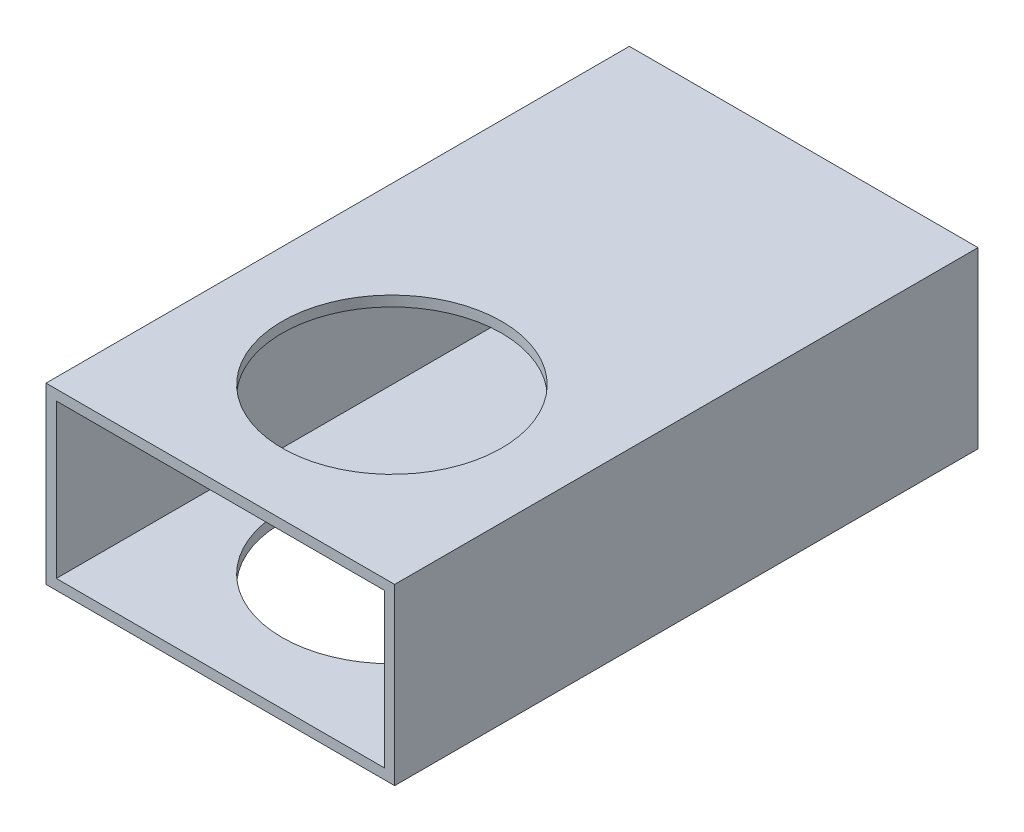
ISO-10303-21;
HEADER;
FILE_DESCRIPTION(('STEP AP214'),'2;1');
FILE_NAME('part.step','',(''),(''),'','','');
FILE_SCHEMA(('AUTOMOTIVE_DESIGN { 1 0 10303 214 1 1 1 1 }'));
ENDSEC;
DATA;
#1=APPLICATION_CONTEXT('core data for automotive mechanical design processes');
#2=APPLICATION_PROTOCOL_DEFINITION('international standard','automotive_design',2000,#1);
#3=PRODUCT_CONTEXT('',#1,'mechanical');
#4=PRODUCT('Part','Part','',(#3));
#5=PRODUCT_RELATED_PRODUCT_CATEGORY('part','',(#4));
#6=PRODUCT_DEFINITION_FORMATION('','',#4);
#7=PRODUCT_DEFINITION_CONTEXT('part definition',#1,'design');
#8=PRODUCT_DEFINITION('design','',#6,#7);
#9=PRODUCT_DEFINITION_SHAPE('','',#8);
#10=(LENGTH_UNIT() NAMED_UNIT(*) SI_UNIT(.MILLI.,.METRE.));
#11=(NAMED_UNIT(*) PLANE_ANGLE_UNIT() SI_UNIT($,.RADIAN.));
#12=(NAMED_UNIT(*) SI_UNIT($,.STERADIAN.) SOLID_ANGLE_UNIT());
#13=UNCERTAINTY_MEASURE_WITH_UNIT(LENGTH_MEASURE(1.E-05),#10,'distance_accuracy_value','');
#14=(GEOMETRIC_REPRESENTATION_CONTEXT(3) GLOBAL_UNCERTAINTY_ASSIGNED_CONTEXT((#13)) GLOBAL_UNIT_ASSIGNED_CONTEXT((#10,
#11,#12)) REPRESENTATION_CONTEXT('',''));
#15=CARTESIAN_POINT('',(0.,0.,0.));
#16=DIRECTION('',(0.,0.,1.));
#17=DIRECTION('',(1.,0.,0.));
#18=AXIS2_PLACEMENT_3D('',#15,#16,#17);
#19=CARTESIAN_POINT('',(0.,0.,85.));
#20=DIRECTION('',(0.,0.,-1.));
#21=DIRECTION('',(-1.,0.,0.));
#22=AXIS2_PLACEMENT_3D('',#19,#20,#21);
#23=PLANE('',#22);
#24=DIRECTION('',(0.,1.,0.));
#25=VECTOR('',#24,1.);
#26=CARTESIAN_POINT('',(25.4,-12.7,85.0000000000001));
#27=LINE('',#26,#25);
#28=CARTESIAN_POINT('',(25.4,-12.7,85.0000000000001));
#29=VERTEX_POINT('',#28);
#30=CARTESIAN_POINT('',(25.4,12.6999999999999,85.));
#31=VERTEX_POINT('',#30);
#32=EDGE_CURVE('E142',#29,#31,#27,.T.);
#33=ORIENTED_EDGE('',*,*,#32,.T.);
#34=DIRECTION('',(-1.,0.,0.));
#35=VECTOR('',#34,1.);
#36=CARTESIAN_POINT('',(-25.4,12.6999999999999,85.));
#37=LINE('',#36,#35);
#38=CARTESIAN_POINT('',(-25.4,12.6999999999999,85.));
#39=VERTEX_POINT('',#38);
#40=EDGE_CURVE('E145',#31,#39,#37,.T.);
#41=ORIENTED_EDGE('',*,*,#40,.T.);
#42=DIRECTION('',(0.,-1.,0.));
#43=VECTOR('',#42,1.);
#44=CARTESIAN_POINT('',(-25.4,-12.7,85.));
#45=LINE('',#44,#43);
#46=CARTESIAN_POINT('',(-25.4,-12.7,85.));
#47=VERTEX_POINT('',#46);
#48=EDGE_CURVE('E148',#39,#47,#45,.T.);
#49=ORIENTED_EDGE('',*,*,#48,.T.);
#50=DIRECTION('',(1.,0.,0.));
#51=VECTOR('',#50,1.);
#52=CARTESIAN_POINT('',(-25.4,-12.7,85.));
#53=LINE('',#52,#51);
#54=EDGE_CURVE('E150',#47,#29,#53,.T.);
#55=ORIENTED_EDGE('',*,*,#54,.T.);
#56=EDGE_LOOP('',(#33,#41,#49,#55));
#57=FACE_BOUND('',#56,.T.);
#58=DIRECTION('',(1.,0.,0.));
#59=VECTOR('',#58,1.);
#60=CARTESIAN_POINT('',(-23.9,-11.2,85.));
#61=LINE('',#60,#59);
#62=CARTESIAN_POINT('',(-23.9,-11.2,85.));
#63=VERTEX_POINT('',#62);
#64=CARTESIAN_POINT('',(23.9,-11.2,85.0000000000001));
#65=VERTEX_POINT('',#64);
#66=EDGE_CURVE('E104',#63,#65,#61,.T.);
#67=ORIENTED_EDGE('',*,*,#66,.F.);
#68=DIRECTION('',(0.,-1.,0.));
#69=VECTOR('',#68,1.);
#70=CARTESIAN_POINT('',(-23.9,-11.2,85.));
#71=LINE('',#70,#69);
#72=CARTESIAN_POINT('',(-23.9,11.2,85.));
#73=VERTEX_POINT('',#72);
#74=EDGE_CURVE('E126',#73,#63,#71,.T.);
#75=ORIENTED_EDGE('',*,*,#74,.F.);
#76=DIRECTION('',(-1.,0.,0.));
#77=VECTOR('',#76,1.);
#78=CARTESIAN_POINT('',(-23.9,11.2,85.));
#79=LINE('',#78,#77);
#80=CARTESIAN_POINT('',(23.9,11.2,85.));
#81=VERTEX_POINT('',#80);
#82=EDGE_CURVE('E124',#81,#73,#79,.T.);
#83=ORIENTED_EDGE('',*,*,#82,.F.);
#84=DIRECTION('',(0.,1.,0.));
#85=VECTOR('',#84,1.);
#86=CARTESIAN_POINT('',(23.9,-11.2,85.0000000000001));
#87=LINE('',#86,#85);
#88=EDGE_CURVE('E112',#65,#81,#87,.T.);
#89=ORIENTED_EDGE('',*,*,#88,.F.);
#90=EDGE_LOOP('',(#67,#75,#83,#89));
#91=FACE_BOUND('',#90,.T.);
#92=ADVANCED_FACE('F38',(#57,#91),#23,.F.);
#93=CARTESIAN_POINT('',(0.,0.,0.));
#94=DIRECTION('',(0.,0.,-1.));
#95=DIRECTION('',(-1.,0.,0.));
#96=AXIS2_PLACEMENT_3D('',#93,#94,#95);
#97=PLANE('',#96);
#98=DIRECTION('',(0.,1.,0.));
#99=VECTOR('',#98,1.);
#100=CARTESIAN_POINT('',(25.4,-12.6999999999999,0.));
#101=LINE('',#100,#99);
#102=CARTESIAN_POINT('',(25.4,-12.6999999999999,0.));
#103=VERTEX_POINT('',#102);
#104=CARTESIAN_POINT('',(25.4,12.7,0.));
#105=VERTEX_POINT('',#104);
#106=EDGE_CURVE('E120',#103,#105,#101,.T.);
#107=ORIENTED_EDGE('',*,*,#106,.F.);
#108=DIRECTION('',(1.,0.,0.));
#109=VECTOR('',#108,1.);
#110=CARTESIAN_POINT('',(-25.4,-12.6999999999997,0.));
#111=LINE('',#110,#109);
#112=CARTESIAN_POINT('',(-25.4,-12.6999999999997,0.));
#113=VERTEX_POINT('',#112);
#114=EDGE_CURVE('E146',#113,#103,#111,.T.);
#115=ORIENTED_EDGE('',*,*,#114,.F.);
#116=DIRECTION('',(0.,-1.,0.));
#117=VECTOR('',#116,1.);
#118=CARTESIAN_POINT('',(-25.4,-12.6999999999997,0.));
#119=LINE('',#118,#117);
#120=CARTESIAN_POINT('',(-25.4,12.7000000000003,0.));
#121=VERTEX_POINT('',#120);
#122=EDGE_CURVE('E157',#121,#113,#119,.T.);
#123=ORIENTED_EDGE('',*,*,#122,.F.);
#124=DIRECTION('',(-1.,0.,0.));
#125=VECTOR('',#124,1.);
#126=CARTESIAN_POINT('',(-25.4,12.7000000000003,0.));
#127=LINE('',#126,#125);
#128=EDGE_CURVE('E155',#105,#121,#127,.T.);
#129=ORIENTED_EDGE('',*,*,#128,.F.);
#130=EDGE_LOOP('',(#107,#115,#123,#129));
#131=FACE_BOUND('',#130,.T.);
#132=DIRECTION('',(0.,-1.,0.));
#133=VECTOR('',#132,1.);
#134=CARTESIAN_POINT('',(-23.9,-11.1999999999997,0.));
#135=LINE('',#134,#133);
#136=CARTESIAN_POINT('',(-23.9,11.2000000000003,0.));
#137=VERTEX_POINT('',#136);
#138=CARTESIAN_POINT('',(-23.9,-11.1999999999997,0.));
#139=VERTEX_POINT('',#138);
#140=EDGE_CURVE('E113',#137,#139,#135,.T.);
#141=ORIENTED_EDGE('',*,*,#140,.T.);
#142=DIRECTION('',(1.,0.,0.));
#143=VECTOR('',#142,1.);
#144=CARTESIAN_POINT('',(-23.9,-11.1999999999997,0.));
#145=LINE('',#144,#143);
#146=CARTESIAN_POINT('',(23.9,-11.2,0.));
#147=VERTEX_POINT('',#146);
#148=EDGE_CURVE('E62',#139,#147,#145,.T.);
#149=ORIENTED_EDGE('',*,*,#148,.T.);
#150=DIRECTION('',(0.,1.,0.));
#151=VECTOR('',#150,1.);
#152=CARTESIAN_POINT('',(23.9,-11.2,0.));
#153=LINE('',#152,#151);
#154=CARTESIAN_POINT('',(23.9,11.2,0.));
#155=VERTEX_POINT('',#154);
#156=EDGE_CURVE('E119',#147,#155,#153,.T.);
#157=ORIENTED_EDGE('',*,*,#156,.T.);
#158=DIRECTION('',(-1.,0.,0.));
#159=VECTOR('',#158,1.);
#160=CARTESIAN_POINT('',(-23.9,11.2000000000003,0.));
#161=LINE('',#160,#159);
#162=EDGE_CURVE('E134',#155,#137,#161,.T.);
#163=ORIENTED_EDGE('',*,*,#162,.T.);
#164=EDGE_LOOP('',(#141,#149,#157,#163));
#165=FACE_BOUND('',#164,.T.);
#166=ADVANCED_FACE('F176',(#131,#165),#97,.T.);
#167=CARTESIAN_POINT('',(25.4,-12.7,85.0000000000001));
#168=DIRECTION('',(-1.,0.,0.));
#169=DIRECTION('',(0.,0.,1.));
#170=AXIS2_PLACEMENT_3D('',#167,#168,#169);
#171=PLANE('',#170);
#172=ORIENTED_EDGE('',*,*,#106,.T.);
#173=DIRECTION('',(0.,0.,-1.));
#174=VECTOR('',#173,1.);
#175=CARTESIAN_POINT('',(25.4,12.6999999999999,85.));
#176=LINE('',#175,#174);
#177=EDGE_CURVE('E11',#31,#105,#176,.T.);
#178=ORIENTED_EDGE('',*,*,#177,.F.);
#179=ORIENTED_EDGE('',*,*,#32,.F.);
#180=DIRECTION('',(0.,0.,-1.));
#181=VECTOR('',#180,1.);
#182=CARTESIAN_POINT('',(25.4,-12.7,85.0000000000001));
#183=LINE('',#182,#181);
#184=EDGE_CURVE('E152',#29,#103,#183,.T.);
#185=ORIENTED_EDGE('',*,*,#184,.T.);
#186=EDGE_LOOP('',(#172,#178,#179,#185));
#187=FACE_BOUND('',#186,.T.);
#188=ADVANCED_FACE('F40',(#187),#171,.F.);
#189=CARTESIAN_POINT('',(-25.4,12.6999999999999,85.));
#190=DIRECTION('',(0.,-1.,0.));
#191=DIRECTION('',(0.,0.,-1.));
#192=AXIS2_PLACEMENT_3D('',#189,#190,#191);
#193=PLANE('',#192);
#194=CARTESIAN_POINT('',(0.,12.7,60.));
#195=DIRECTION('',(0.,-1.,0.));
#196=DIRECTION('',(0.,0.,-1.));
#197=AXIS2_PLACEMENT_3D('',#194,#195,#196);
#198=CIRCLE('',#197,16.);
#199=CARTESIAN_POINT('',(0.,12.7000000000001,44.));
#200=VERTEX_POINT('',#199);
#201=EDGE_CURVE('E132',#200,#200,#198,.T.);
#202=ORIENTED_EDGE('',*,*,#201,.T.);
#203=EDGE_LOOP('',(#202));
#204=FACE_BOUND('',#203,.T.);
#205=ORIENTED_EDGE('',*,*,#128,.T.);
#206=DIRECTION('',(0.,0.,-1.));
#207=VECTOR('',#206,1.);
#208=CARTESIAN_POINT('',(-25.4,12.6999999999999,85.));
#209=LINE('',#208,#207);
#210=EDGE_CURVE('E47',#39,#121,#209,.T.);
#211=ORIENTED_EDGE('',*,*,#210,.F.);
#212=ORIENTED_EDGE('',*,*,#40,.F.);
#213=ORIENTED_EDGE('',*,*,#177,.T.);
#214=EDGE_LOOP('',(#205,#211,#212,#213));
#215=FACE_BOUND('',#214,.T.);
#216=ADVANCED_FACE('F186',(#204,#215),#193,.F.);
#217=CARTESIAN_POINT('',(-25.4,-12.7,85.));
#218=DIRECTION('',(1.,0.,0.));
#219=DIRECTION('',(0.,0.,-1.));
#220=AXIS2_PLACEMENT_3D('',#217,#218,#219);
#221=PLANE('',#220);
#222=ORIENTED_EDGE('',*,*,#122,.T.);
#223=DIRECTION('',(0.,0.,-1.));
#224=VECTOR('',#223,1.);
#225=CARTESIAN_POINT('',(-25.4,-12.7,85.));
#226=LINE('',#225,#224);
#227=EDGE_CURVE('E162',#47,#113,#226,.T.);
#228=ORIENTED_EDGE('',*,*,#227,.F.);
#229=ORIENTED_EDGE('',*,*,#48,.F.);
#230=ORIENTED_EDGE('',*,*,#210,.T.);
#231=EDGE_LOOP('',(#222,#228,#229,#230));
#232=FACE_BOUND('',#231,.T.);
#233=ADVANCED_FACE('F170',(#232),#221,.F.);
#234=CARTESIAN_POINT('',(-25.4,-12.7,85.));
#235=DIRECTION('',(0.,1.,0.));
#236=DIRECTION('',(0.,0.,1.));
#237=AXIS2_PLACEMENT_3D('',#234,#235,#236);
#238=PLANE('',#237);
#239=CARTESIAN_POINT('',(0.,-12.6999999999999,60.0000000000001));
#240=DIRECTION('',(0.,-1.,0.));
#241=DIRECTION('',(0.,0.,-1.));
#242=AXIS2_PLACEMENT_3D('',#239,#240,#241);
#243=CIRCLE('',#242,16.);
#244=CARTESIAN_POINT('',(0.,-12.6999999999999,44.));
#245=VERTEX_POINT('',#244);
#246=EDGE_CURVE('E212',#245,#245,#243,.T.);
#247=ORIENTED_EDGE('',*,*,#246,.F.);
#248=EDGE_LOOP('',(#247));
#249=FACE_BOUND('',#248,.T.);
#250=ORIENTED_EDGE('',*,*,#114,.T.);
#251=ORIENTED_EDGE('',*,*,#184,.F.);
#252=ORIENTED_EDGE('',*,*,#54,.F.);
#253=ORIENTED_EDGE('',*,*,#227,.T.);
#254=EDGE_LOOP('',(#250,#251,#252,#253));
#255=FACE_BOUND('',#254,.T.);
#256=ADVANCED_FACE('F180',(#249,#255),#238,.F.);
#257=CARTESIAN_POINT('',(-23.9,-11.2,85.));
#258=DIRECTION('',(0.,1.,0.));
#259=DIRECTION('',(0.,0.,1.));
#260=AXIS2_PLACEMENT_3D('',#257,#258,#259);
#261=PLANE('',#260);
#262=CARTESIAN_POINT('',(0.,-11.2,60.0000000000001));
#263=DIRECTION('',(0.,1.,0.));
#264=DIRECTION('',(0.,0.,1.));
#265=AXIS2_PLACEMENT_3D('',#262,#263,#264);
#266=CIRCLE('',#265,16.);
#267=CARTESIAN_POINT('',(0.,-11.2,76.0000000000001));
#268=VERTEX_POINT('',#267);
#269=EDGE_CURVE('E216',#268,#268,#266,.T.);
#270=ORIENTED_EDGE('',*,*,#269,.F.);
#271=EDGE_LOOP('',(#270));
#272=FACE_BOUND('',#271,.T.);
#273=ORIENTED_EDGE('',*,*,#148,.F.);
#274=DIRECTION('',(0.,0.,-1.));
#275=VECTOR('',#274,1.);
#276=CARTESIAN_POINT('',(-23.9,-11.2,85.));
#277=LINE('',#276,#275);
#278=EDGE_CURVE('E108',#63,#139,#277,.T.);
#279=ORIENTED_EDGE('',*,*,#278,.F.);
#280=ORIENTED_EDGE('',*,*,#66,.T.);
#281=DIRECTION('',(0.,0.,-1.));
#282=VECTOR('',#281,1.);
#283=CARTESIAN_POINT('',(23.9,-11.2,85.0000000000001));
#284=LINE('',#283,#282);
#285=EDGE_CURVE('E107',#65,#147,#284,.T.);
#286=ORIENTED_EDGE('',*,*,#285,.T.);
#287=EDGE_LOOP('',(#273,#279,#280,#286));
#288=FACE_BOUND('',#287,.T.);
#289=ADVANCED_FACE('F106',(#272,#288),#261,.T.);
#290=CARTESIAN_POINT('',(23.9,-11.2,85.0000000000001));
#291=DIRECTION('',(-1.,0.,0.));
#292=DIRECTION('',(0.,0.,1.));
#293=AXIS2_PLACEMENT_3D('',#290,#291,#292);
#294=PLANE('',#293);
#295=ORIENTED_EDGE('',*,*,#156,.F.);
#296=ORIENTED_EDGE('',*,*,#285,.F.);
#297=ORIENTED_EDGE('',*,*,#88,.T.);
#298=DIRECTION('',(0.,0.,-1.));
#299=VECTOR('',#298,1.);
#300=CARTESIAN_POINT('',(23.9,11.2,85.));
#301=LINE('',#300,#299);
#302=EDGE_CURVE('E121',#81,#155,#301,.T.);
#303=ORIENTED_EDGE('',*,*,#302,.T.);
#304=EDGE_LOOP('',(#295,#296,#297,#303));
#305=FACE_BOUND('',#304,.T.);
#306=ADVANCED_FACE('F116',(#305),#294,.T.);
#307=CARTESIAN_POINT('',(-23.9,11.2,85.));
#308=DIRECTION('',(0.,-1.,0.));
#309=DIRECTION('',(1.,0.,0.));
#310=AXIS2_PLACEMENT_3D('',#307,#308,#309);
#311=PLANE('',#310);
#312=CARTESIAN_POINT('',(0.,11.2,60.));
#313=DIRECTION('',(0.,-1.,0.));
#314=DIRECTION('',(1.,0.,0.));
#315=AXIS2_PLACEMENT_3D('',#312,#313,#314);
#316=CIRCLE('',#315,16.);
#317=CARTESIAN_POINT('',(16.,11.2,60.));
#318=VERTEX_POINT('',#317);
#319=EDGE_CURVE('E42',#318,#318,#316,.T.);
#320=ORIENTED_EDGE('',*,*,#319,.F.);
#321=EDGE_LOOP('',(#320));
#322=FACE_BOUND('',#321,.T.);
#323=ORIENTED_EDGE('',*,*,#162,.F.);
#324=ORIENTED_EDGE('',*,*,#302,.F.);
#325=ORIENTED_EDGE('',*,*,#82,.T.);
#326=DIRECTION('',(0.,0.,-1.));
#327=VECTOR('',#326,1.);
#328=CARTESIAN_POINT('',(-23.9,11.2,85.));
#329=LINE('',#328,#327);
#330=EDGE_CURVE('E54',#73,#137,#329,.T.);
#331=ORIENTED_EDGE('',*,*,#330,.T.);
#332=EDGE_LOOP('',(#323,#324,#325,#331));
#333=FACE_BOUND('',#332,.T.);
#334=ADVANCED_FACE('F232',(#322,#333),#311,.T.);
#335=CARTESIAN_POINT('',(-23.9,-11.2,85.));
#336=DIRECTION('',(1.,0.,0.));
#337=DIRECTION('',(0.,0.,-1.));
#338=AXIS2_PLACEMENT_3D('',#335,#336,#337);
#339=PLANE('',#338);
#340=ORIENTED_EDGE('',*,*,#140,.F.);
#341=ORIENTED_EDGE('',*,*,#330,.F.);
#342=ORIENTED_EDGE('',*,*,#74,.T.);
#343=ORIENTED_EDGE('',*,*,#278,.T.);
#344=EDGE_LOOP('',(#340,#341,#342,#343));
#345=FACE_BOUND('',#344,.T.);
#346=ADVANCED_FACE('F224',(#345),#339,.T.);
#347=CARTESIAN_POINT('',(0.,13.3000000000001,60.));
#348=DIRECTION('',(0.,-1.,0.));
#349=DIRECTION('',(0.,0.,-1.));
#350=AXIS2_PLACEMENT_3D('',#347,#348,#349);
#351=CYLINDRICAL_SURFACE('',#350,16.);
#352=ORIENTED_EDGE('',*,*,#319,.T.);
#353=EDGE_LOOP('',(#352));
#354=FACE_BOUND('',#353,.T.);
#355=ORIENTED_EDGE('',*,*,#201,.F.);
#356=EDGE_LOOP('',(#355));
#357=FACE_BOUND('',#356,.T.);
#358=ADVANCED_FACE('F221',(#354,#357),#351,.F.);
#359=ORIENTED_EDGE('',*,*,#269,.T.);
#360=EDGE_LOOP('',(#359));
#361=FACE_BOUND('',#360,.T.);
#362=ORIENTED_EDGE('',*,*,#246,.T.);
#363=EDGE_LOOP('',(#362));
#364=FACE_BOUND('',#363,.T.);
#365=ADVANCED_FACE('F223',(#361,#364),#351,.F.);
#366=CLOSED_SHELL('',(#92,#166,#188,#216,#233,#256,#289,#306,#334,#346,#358,#365));
#367=MANIFOLD_SOLID_BREP('B2',#366);
#368=ADVANCED_BREP_SHAPE_REPRESENTATION('',(#18,#367),#14);
#369=SHAPE_DEFINITION_REPRESENTATION(#9,#368);
ENDSEC;
END-ISO-10303-21;
